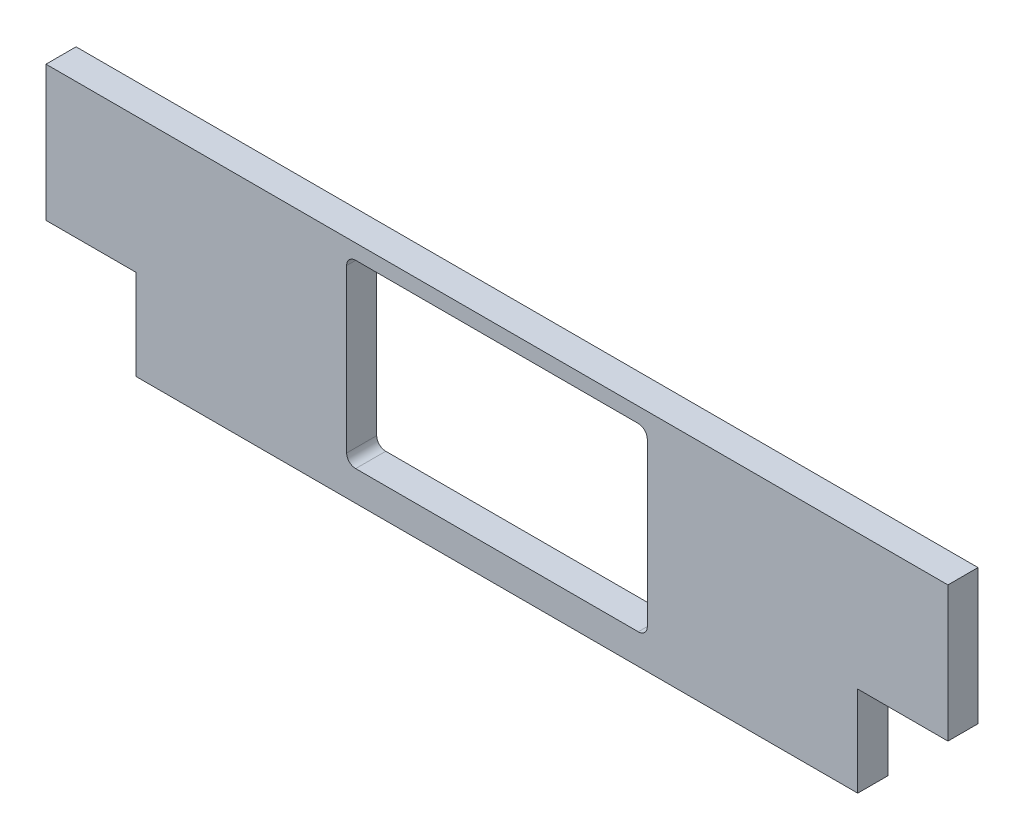
ISO-10303-21;
HEADER;
FILE_DESCRIPTION(('STEP AP214'),'2;1');
FILE_NAME('part.step','',(''),(''),'','','');
FILE_SCHEMA(('AUTOMOTIVE_DESIGN { 1 0 10303 214 1 1 1 1 }'));
ENDSEC;
DATA;
#1=APPLICATION_CONTEXT('core data for automotive mechanical design processes');
#2=APPLICATION_PROTOCOL_DEFINITION('international standard','automotive_design',2000,#1);
#3=PRODUCT_CONTEXT('',#1,'mechanical');
#4=PRODUCT('Part','Part','',(#3));
#5=PRODUCT_RELATED_PRODUCT_CATEGORY('part','',(#4));
#6=PRODUCT_DEFINITION_FORMATION('','',#4);
#7=PRODUCT_DEFINITION_CONTEXT('part definition',#1,'design');
#8=PRODUCT_DEFINITION('design','',#6,#7);
#9=PRODUCT_DEFINITION_SHAPE('','',#8);
#10=(LENGTH_UNIT() NAMED_UNIT(*) SI_UNIT(.MILLI.,.METRE.));
#11=(NAMED_UNIT(*) PLANE_ANGLE_UNIT() SI_UNIT($,.RADIAN.));
#12=(NAMED_UNIT(*) SI_UNIT($,.STERADIAN.) SOLID_ANGLE_UNIT());
#13=UNCERTAINTY_MEASURE_WITH_UNIT(LENGTH_MEASURE(1.E-05),#10,'distance_accuracy_value','');
#14=(GEOMETRIC_REPRESENTATION_CONTEXT(3) GLOBAL_UNCERTAINTY_ASSIGNED_CONTEXT((#13)) GLOBAL_UNIT_ASSIGNED_CONTEXT((#10,
#11,#12)) REPRESENTATION_CONTEXT('',''));
#15=CARTESIAN_POINT('',(0.,0.,0.));
#16=DIRECTION('',(0.,0.,1.));
#17=DIRECTION('',(1.,0.,0.));
#18=AXIS2_PLACEMENT_3D('',#15,#16,#17);
#19=CARTESIAN_POINT('',(150.,-150.,10.));
#20=DIRECTION('',(0.,1.,0.));
#21=DIRECTION('',(-1.,0.,0.));
#22=AXIS2_PLACEMENT_3D('',#19,#20,#21);
#23=PLANE('',#22);
#24=DIRECTION('',(0.,0.,-1.));
#25=VECTOR('',#24,1.);
#26=CARTESIAN_POINT('',(-120.,-150.,10.));
#27=LINE('',#26,#25);
#28=CARTESIAN_POINT('',(-120.,-150.,10.));
#29=VERTEX_POINT('',#28);
#30=CARTESIAN_POINT('',(-120.,-150.,0.));
#31=VERTEX_POINT('',#30);
#32=EDGE_CURVE('E147',#29,#31,#27,.T.);
#33=ORIENTED_EDGE('',*,*,#32,.T.);
#34=DIRECTION('',(1.,0.,0.));
#35=VECTOR('',#34,1.);
#36=CARTESIAN_POINT('',(150.,-150.,0.));
#37=LINE('',#36,#35);
#38=CARTESIAN_POINT('',(120.,-150.,0.));
#39=VERTEX_POINT('',#38);
#40=EDGE_CURVE('E54',#31,#39,#37,.T.);
#41=ORIENTED_EDGE('',*,*,#40,.T.);
#42=DIRECTION('',(0.,0.,-1.));
#43=VECTOR('',#42,1.);
#44=CARTESIAN_POINT('',(120.,-150.,10.));
#45=LINE('',#44,#43);
#46=CARTESIAN_POINT('',(120.,-150.,10.));
#47=VERTEX_POINT('',#46);
#48=EDGE_CURVE('E288',#47,#39,#45,.T.);
#49=ORIENTED_EDGE('',*,*,#48,.F.);
#50=DIRECTION('',(1.,0.,0.));
#51=VECTOR('',#50,1.);
#52=CARTESIAN_POINT('',(150.,-150.,10.));
#53=LINE('',#52,#51);
#54=EDGE_CURVE('E154',#29,#47,#53,.T.);
#55=ORIENTED_EDGE('',*,*,#54,.F.);
#56=EDGE_LOOP('',(#33,#41,#49,#55));
#57=FACE_BOUND('',#56,.T.);
#58=ADVANCED_FACE('F31',(#57),#23,.F.);
#59=CARTESIAN_POINT('',(-150.,-150.,10.));
#60=DIRECTION('',(1.,0.,0.));
#61=DIRECTION('',(0.,0.,-1.));
#62=AXIS2_PLACEMENT_3D('',#59,#60,#61);
#63=PLANE('',#62);
#64=DIRECTION('',(0.,0.,1.));
#65=VECTOR('',#64,1.);
#66=CARTESIAN_POINT('',(-150.,-120.,0.));
#67=LINE('',#66,#65);
#68=CARTESIAN_POINT('',(-150.,-120.,0.));
#69=VERTEX_POINT('',#68);
#70=CARTESIAN_POINT('',(-150.,-120.,10.));
#71=VERTEX_POINT('',#70);
#72=EDGE_CURVE('E151',#69,#71,#67,.T.);
#73=ORIENTED_EDGE('',*,*,#72,.T.);
#74=DIRECTION('',(0.,-1.,0.));
#75=VECTOR('',#74,1.);
#76=CARTESIAN_POINT('',(-150.,-150.,10.));
#77=LINE('',#76,#75);
#78=CARTESIAN_POINT('',(-150.,-75.,10.));
#79=VERTEX_POINT('',#78);
#80=EDGE_CURVE('E257',#79,#71,#77,.T.);
#81=ORIENTED_EDGE('',*,*,#80,.F.);
#82=DIRECTION('',(0.,0.,-1.));
#83=VECTOR('',#82,1.);
#84=CARTESIAN_POINT('',(-150.,-75.,10.));
#85=LINE('',#84,#83);
#86=CARTESIAN_POINT('',(-150.,-75.,0.));
#87=VERTEX_POINT('',#86);
#88=EDGE_CURVE('E172',#79,#87,#85,.T.);
#89=ORIENTED_EDGE('',*,*,#88,.T.);
#90=DIRECTION('',(0.,-1.,0.));
#91=VECTOR('',#90,1.);
#92=CARTESIAN_POINT('',(-150.,-150.,0.));
#93=LINE('',#92,#91);
#94=EDGE_CURVE('E163',#87,#69,#93,.T.);
#95=ORIENTED_EDGE('',*,*,#94,.T.);
#96=EDGE_LOOP('',(#73,#81,#89,#95));
#97=FACE_BOUND('',#96,.T.);
#98=ADVANCED_FACE('F272',(#97),#63,.F.);
#99=CARTESIAN_POINT('',(150.,-75.,10.));
#100=DIRECTION('',(0.,0.,1.));
#101=DIRECTION('',(1.,0.,0.));
#102=AXIS2_PLACEMENT_3D('',#99,#100,#101);
#103=PLANE('',#102);
#104=DIRECTION('',(0.,1.,0.));
#105=VECTOR('',#104,1.);
#106=CARTESIAN_POINT('',(50.,-140.,10.));
#107=LINE('',#106,#105);
#108=CARTESIAN_POINT('',(50.,-137.,10.));
#109=VERTEX_POINT('',#108);
#110=CARTESIAN_POINT('',(50.,-83.,10.));
#111=VERTEX_POINT('',#110);
#112=EDGE_CURVE('E215',#109,#111,#107,.T.);
#113=ORIENTED_EDGE('',*,*,#112,.F.);
#114=CARTESIAN_POINT('',(47.,-137.,10.));
#115=DIRECTION('',(0.,0.,1.));
#116=DIRECTION('',(1.,0.,0.));
#117=AXIS2_PLACEMENT_3D('',#114,#115,#116);
#118=CIRCLE('',#117,3.);
#119=CARTESIAN_POINT('',(47.,-140.,10.));
#120=VERTEX_POINT('',#119);
#121=EDGE_CURVE('E202',#109,#120,#118,.F.);
#122=ORIENTED_EDGE('',*,*,#121,.T.);
#123=DIRECTION('',(1.,0.,0.));
#124=VECTOR('',#123,1.);
#125=CARTESIAN_POINT('',(50.,-140.,10.));
#126=LINE('',#125,#124);
#127=CARTESIAN_POINT('',(-47.,-140.,10.));
#128=VERTEX_POINT('',#127);
#129=EDGE_CURVE('E243',#128,#120,#126,.T.);
#130=ORIENTED_EDGE('',*,*,#129,.F.);
#131=CARTESIAN_POINT('',(-47.,-137.,10.));
#132=DIRECTION('',(0.,0.,1.));
#133=DIRECTION('',(1.,0.,0.));
#134=AXIS2_PLACEMENT_3D('',#131,#132,#133);
#135=CIRCLE('',#134,3.);
#136=CARTESIAN_POINT('',(-50.,-137.,10.));
#137=VERTEX_POINT('',#136);
#138=EDGE_CURVE('E198',#128,#137,#135,.F.);
#139=ORIENTED_EDGE('',*,*,#138,.T.);
#140=DIRECTION('',(0.,-1.,0.));
#141=VECTOR('',#140,1.);
#142=CARTESIAN_POINT('',(-50.,-140.,10.));
#143=LINE('',#142,#141);
#144=CARTESIAN_POINT('',(-50.,-83.,10.));
#145=VERTEX_POINT('',#144);
#146=EDGE_CURVE('E251',#145,#137,#143,.T.);
#147=ORIENTED_EDGE('',*,*,#146,.F.);
#148=CARTESIAN_POINT('',(-47.,-83.,10.));
#149=DIRECTION('',(0.,0.,1.));
#150=DIRECTION('',(1.,0.,0.));
#151=AXIS2_PLACEMENT_3D('',#148,#149,#150);
#152=CIRCLE('',#151,3.);
#153=CARTESIAN_POINT('',(-47.,-80.,10.));
#154=VERTEX_POINT('',#153);
#155=EDGE_CURVE('E206',#145,#154,#152,.F.);
#156=ORIENTED_EDGE('',*,*,#155,.T.);
#157=DIRECTION('',(-1.,0.,0.));
#158=VECTOR('',#157,1.);
#159=CARTESIAN_POINT('',(50.,-80.,10.));
#160=LINE('',#159,#158);
#161=CARTESIAN_POINT('',(47.,-80.,10.));
#162=VERTEX_POINT('',#161);
#163=EDGE_CURVE('E217',#162,#154,#160,.T.);
#164=ORIENTED_EDGE('',*,*,#163,.F.);
#165=CARTESIAN_POINT('',(47.,-83.,10.));
#166=DIRECTION('',(0.,0.,1.));
#167=DIRECTION('',(1.,0.,0.));
#168=AXIS2_PLACEMENT_3D('',#165,#166,#167);
#169=CIRCLE('',#168,3.);
#170=EDGE_CURVE('E39',#162,#111,#169,.F.);
#171=ORIENTED_EDGE('',*,*,#170,.T.);
#172=EDGE_LOOP('',(#113,#122,#130,#139,#147,#156,#164,#171));
#173=FACE_BOUND('',#172,.T.);
#174=ORIENTED_EDGE('',*,*,#80,.T.);
#175=DIRECTION('',(-1.,0.,0.));
#176=VECTOR('',#175,1.);
#177=CARTESIAN_POINT('',(-120.,-120.,10.));
#178=LINE('',#177,#176);
#179=CARTESIAN_POINT('',(-120.,-120.,10.));
#180=VERTEX_POINT('',#179);
#181=EDGE_CURVE('E274',#180,#71,#178,.T.);
#182=ORIENTED_EDGE('',*,*,#181,.F.);
#183=DIRECTION('',(0.,-1.,0.));
#184=VECTOR('',#183,1.);
#185=CARTESIAN_POINT('',(-120.,-120.,10.));
#186=LINE('',#185,#184);
#187=EDGE_CURVE('E155',#180,#29,#186,.T.);
#188=ORIENTED_EDGE('',*,*,#187,.T.);
#189=ORIENTED_EDGE('',*,*,#54,.T.);
#190=DIRECTION('',(0.,-1.,0.));
#191=VECTOR('',#190,1.);
#192=CARTESIAN_POINT('',(120.,-120.,10.));
#193=LINE('',#192,#191);
#194=CARTESIAN_POINT('',(120.,-120.,10.));
#195=VERTEX_POINT('',#194);
#196=EDGE_CURVE('E285',#195,#47,#193,.T.);
#197=ORIENTED_EDGE('',*,*,#196,.F.);
#198=DIRECTION('',(1.,0.,0.));
#199=VECTOR('',#198,1.);
#200=CARTESIAN_POINT('',(120.,-120.,10.));
#201=LINE('',#200,#199);
#202=CARTESIAN_POINT('',(150.,-120.,10.));
#203=VERTEX_POINT('',#202);
#204=EDGE_CURVE('E226',#195,#203,#201,.T.);
#205=ORIENTED_EDGE('',*,*,#204,.T.);
#206=DIRECTION('',(0.,1.,0.));
#207=VECTOR('',#206,1.);
#208=CARTESIAN_POINT('',(150.,-150.,10.));
#209=LINE('',#208,#207);
#210=CARTESIAN_POINT('',(150.,-75.,10.));
#211=VERTEX_POINT('',#210);
#212=EDGE_CURVE('E162',#203,#211,#209,.T.);
#213=ORIENTED_EDGE('',*,*,#212,.T.);
#214=DIRECTION('',(-1.,0.,0.));
#215=VECTOR('',#214,1.);
#216=CARTESIAN_POINT('',(150.,-75.,10.));
#217=LINE('',#216,#215);
#218=EDGE_CURVE('E165',#211,#79,#217,.T.);
#219=ORIENTED_EDGE('',*,*,#218,.T.);
#220=EDGE_LOOP('',(#174,#182,#188,#189,#197,#205,#213,#219));
#221=FACE_BOUND('',#220,.T.);
#222=ADVANCED_FACE('F213',(#173,#221),#103,.T.);
#223=CARTESIAN_POINT('',(150.,-75.,0.));
#224=DIRECTION('',(0.,0.,1.));
#225=DIRECTION('',(1.,0.,0.));
#226=AXIS2_PLACEMENT_3D('',#223,#224,#225);
#227=PLANE('',#226);
#228=DIRECTION('',(0.,-1.,0.));
#229=VECTOR('',#228,1.);
#230=CARTESIAN_POINT('',(-50.,-140.,0.));
#231=LINE('',#230,#229);
#232=CARTESIAN_POINT('',(-50.,-83.,0.));
#233=VERTEX_POINT('',#232);
#234=CARTESIAN_POINT('',(-50.,-137.,0.));
#235=VERTEX_POINT('',#234);
#236=EDGE_CURVE('E239',#233,#235,#231,.T.);
#237=ORIENTED_EDGE('',*,*,#236,.T.);
#238=CARTESIAN_POINT('',(-47.,-137.,0.));
#239=DIRECTION('',(0.,0.,1.));
#240=DIRECTION('',(1.,0.,0.));
#241=AXIS2_PLACEMENT_3D('',#238,#239,#240);
#242=CIRCLE('',#241,3.);
#243=CARTESIAN_POINT('',(-47.,-140.,0.));
#244=VERTEX_POINT('',#243);
#245=EDGE_CURVE('E200',#235,#244,#242,.T.);
#246=ORIENTED_EDGE('',*,*,#245,.T.);
#247=DIRECTION('',(1.,0.,0.));
#248=VECTOR('',#247,1.);
#249=CARTESIAN_POINT('',(50.,-140.,0.));
#250=LINE('',#249,#248);
#251=CARTESIAN_POINT('',(47.,-140.,0.));
#252=VERTEX_POINT('',#251);
#253=EDGE_CURVE('E241',#244,#252,#250,.T.);
#254=ORIENTED_EDGE('',*,*,#253,.T.);
#255=CARTESIAN_POINT('',(47.,-137.,0.));
#256=DIRECTION('',(0.,0.,1.));
#257=DIRECTION('',(1.,0.,0.));
#258=AXIS2_PLACEMENT_3D('',#255,#256,#257);
#259=CIRCLE('',#258,3.);
#260=CARTESIAN_POINT('',(50.,-137.,0.));
#261=VERTEX_POINT('',#260);
#262=EDGE_CURVE('E204',#252,#261,#259,.T.);
#263=ORIENTED_EDGE('',*,*,#262,.T.);
#264=DIRECTION('',(0.,1.,0.));
#265=VECTOR('',#264,1.);
#266=CARTESIAN_POINT('',(50.,-140.,0.));
#267=LINE('',#266,#265);
#268=CARTESIAN_POINT('',(50.,-83.,0.));
#269=VERTEX_POINT('',#268);
#270=EDGE_CURVE('E235',#261,#269,#267,.T.);
#271=ORIENTED_EDGE('',*,*,#270,.T.);
#272=CARTESIAN_POINT('',(47.,-83.,0.));
#273=DIRECTION('',(0.,0.,1.));
#274=DIRECTION('',(1.,0.,0.));
#275=AXIS2_PLACEMENT_3D('',#272,#273,#274);
#276=CIRCLE('',#275,3.);
#277=CARTESIAN_POINT('',(47.,-80.,0.));
#278=VERTEX_POINT('',#277);
#279=EDGE_CURVE('E11',#269,#278,#276,.T.);
#280=ORIENTED_EDGE('',*,*,#279,.T.);
#281=DIRECTION('',(-1.,0.,0.));
#282=VECTOR('',#281,1.);
#283=CARTESIAN_POINT('',(50.,-80.,0.));
#284=LINE('',#283,#282);
#285=CARTESIAN_POINT('',(-47.,-80.,0.));
#286=VERTEX_POINT('',#285);
#287=EDGE_CURVE('E233',#278,#286,#284,.T.);
#288=ORIENTED_EDGE('',*,*,#287,.T.);
#289=CARTESIAN_POINT('',(-47.,-83.,0.));
#290=DIRECTION('',(0.,0.,1.));
#291=DIRECTION('',(1.,0.,0.));
#292=AXIS2_PLACEMENT_3D('',#289,#290,#291);
#293=CIRCLE('',#292,3.);
#294=EDGE_CURVE('E208',#286,#233,#293,.T.);
#295=ORIENTED_EDGE('',*,*,#294,.T.);
#296=EDGE_LOOP('',(#237,#246,#254,#263,#271,#280,#288,#295));
#297=FACE_BOUND('',#296,.T.);
#298=DIRECTION('',(-1.,0.,0.));
#299=VECTOR('',#298,1.);
#300=CARTESIAN_POINT('',(-120.,-120.,0.));
#301=LINE('',#300,#299);
#302=CARTESIAN_POINT('',(-120.,-120.,0.));
#303=VERTEX_POINT('',#302);
#304=EDGE_CURVE('E46',#303,#69,#301,.T.);
#305=ORIENTED_EDGE('',*,*,#304,.T.);
#306=ORIENTED_EDGE('',*,*,#94,.F.);
#307=DIRECTION('',(-1.,0.,0.));
#308=VECTOR('',#307,1.);
#309=CARTESIAN_POINT('',(150.,-75.,0.));
#310=LINE('',#309,#308);
#311=CARTESIAN_POINT('',(150.,-75.,0.));
#312=VERTEX_POINT('',#311);
#313=EDGE_CURVE('E168',#312,#87,#310,.T.);
#314=ORIENTED_EDGE('',*,*,#313,.F.);
#315=DIRECTION('',(0.,1.,0.));
#316=VECTOR('',#315,1.);
#317=CARTESIAN_POINT('',(150.,-150.,0.));
#318=LINE('',#317,#316);
#319=CARTESIAN_POINT('',(150.,-120.,0.));
#320=VERTEX_POINT('',#319);
#321=EDGE_CURVE('E248',#320,#312,#318,.T.);
#322=ORIENTED_EDGE('',*,*,#321,.F.);
#323=DIRECTION('',(1.,0.,0.));
#324=VECTOR('',#323,1.);
#325=CARTESIAN_POINT('',(120.,-120.,0.));
#326=LINE('',#325,#324);
#327=CARTESIAN_POINT('',(120.,-120.,0.));
#328=VERTEX_POINT('',#327);
#329=EDGE_CURVE('E289',#328,#320,#326,.T.);
#330=ORIENTED_EDGE('',*,*,#329,.F.);
#331=DIRECTION('',(0.,1.,0.));
#332=VECTOR('',#331,1.);
#333=CARTESIAN_POINT('',(120.,-150.,0.));
#334=LINE('',#333,#332);
#335=EDGE_CURVE('E161',#39,#328,#334,.T.);
#336=ORIENTED_EDGE('',*,*,#335,.F.);
#337=ORIENTED_EDGE('',*,*,#40,.F.);
#338=DIRECTION('',(0.,1.,0.));
#339=VECTOR('',#338,1.);
#340=CARTESIAN_POINT('',(-120.,-150.,0.));
#341=LINE('',#340,#339);
#342=EDGE_CURVE('E144',#31,#303,#341,.T.);
#343=ORIENTED_EDGE('',*,*,#342,.T.);
#344=EDGE_LOOP('',(#305,#306,#314,#322,#330,#336,#337,#343));
#345=FACE_BOUND('',#344,.T.);
#346=ADVANCED_FACE('F158',(#297,#345),#227,.F.);
#347=CARTESIAN_POINT('',(150.,-150.,10.));
#348=DIRECTION('',(-1.,0.,0.));
#349=DIRECTION('',(0.,0.,1.));
#350=AXIS2_PLACEMENT_3D('',#347,#348,#349);
#351=PLANE('',#350);
#352=ORIENTED_EDGE('',*,*,#212,.F.);
#353=DIRECTION('',(0.,0.,1.));
#354=VECTOR('',#353,1.);
#355=CARTESIAN_POINT('',(150.,-120.,0.));
#356=LINE('',#355,#354);
#357=EDGE_CURVE('E273',#320,#203,#356,.T.);
#358=ORIENTED_EDGE('',*,*,#357,.F.);
#359=ORIENTED_EDGE('',*,*,#321,.T.);
#360=DIRECTION('',(0.,0.,-1.));
#361=VECTOR('',#360,1.);
#362=CARTESIAN_POINT('',(150.,-75.,10.));
#363=LINE('',#362,#361);
#364=EDGE_CURVE('E175',#211,#312,#363,.T.);
#365=ORIENTED_EDGE('',*,*,#364,.F.);
#366=EDGE_LOOP('',(#352,#358,#359,#365));
#367=FACE_BOUND('',#366,.T.);
#368=ADVANCED_FACE('F297',(#367),#351,.F.);
#369=CARTESIAN_POINT('',(150.,-75.,10.));
#370=DIRECTION('',(0.,-1.,0.));
#371=DIRECTION('',(1.,0.,0.));
#372=AXIS2_PLACEMENT_3D('',#369,#370,#371);
#373=PLANE('',#372);
#374=ORIENTED_EDGE('',*,*,#313,.T.);
#375=ORIENTED_EDGE('',*,*,#88,.F.);
#376=ORIENTED_EDGE('',*,*,#218,.F.);
#377=ORIENTED_EDGE('',*,*,#364,.T.);
#378=EDGE_LOOP('',(#374,#375,#376,#377));
#379=FACE_BOUND('',#378,.T.);
#380=ADVANCED_FACE('F264',(#379),#373,.F.);
#381=CARTESIAN_POINT('',(50.,-140.,0.));
#382=DIRECTION('',(1.,0.,0.));
#383=DIRECTION('',(0.,0.,-1.));
#384=AXIS2_PLACEMENT_3D('',#381,#382,#383);
#385=PLANE('',#384);
#386=ORIENTED_EDGE('',*,*,#270,.F.);
#387=DIRECTION('',(0.,0.,1.));
#388=VECTOR('',#387,1.);
#389=CARTESIAN_POINT('',(50.,-137.,10.));
#390=LINE('',#389,#388);
#391=EDGE_CURVE('E190',#261,#109,#390,.T.);
#392=ORIENTED_EDGE('',*,*,#391,.T.);
#393=ORIENTED_EDGE('',*,*,#112,.T.);
#394=DIRECTION('',(0.,0.,1.));
#395=VECTOR('',#394,1.);
#396=CARTESIAN_POINT('',(50.,-83.,0.));
#397=LINE('',#396,#395);
#398=EDGE_CURVE('E188',#111,#269,#397,.F.);
#399=ORIENTED_EDGE('',*,*,#398,.T.);
#400=EDGE_LOOP('',(#386,#392,#393,#399));
#401=FACE_BOUND('',#400,.T.);
#402=ADVANCED_FACE('F223',(#401),#385,.F.);
#403=CARTESIAN_POINT('',(50.,-140.,0.));
#404=DIRECTION('',(0.,-1.,0.));
#405=DIRECTION('',(0.,0.,-1.));
#406=AXIS2_PLACEMENT_3D('',#403,#404,#405);
#407=PLANE('',#406);
#408=ORIENTED_EDGE('',*,*,#253,.F.);
#409=DIRECTION('',(0.,0.,1.));
#410=VECTOR('',#409,1.);
#411=CARTESIAN_POINT('',(-47.,-140.,10.));
#412=LINE('',#411,#410);
#413=EDGE_CURVE('E180',#244,#128,#412,.T.);
#414=ORIENTED_EDGE('',*,*,#413,.T.);
#415=ORIENTED_EDGE('',*,*,#129,.T.);
#416=DIRECTION('',(0.,0.,1.));
#417=VECTOR('',#416,1.);
#418=CARTESIAN_POINT('',(47.,-140.,0.));
#419=LINE('',#418,#417);
#420=EDGE_CURVE('E178',#120,#252,#419,.F.);
#421=ORIENTED_EDGE('',*,*,#420,.T.);
#422=EDGE_LOOP('',(#408,#414,#415,#421));
#423=FACE_BOUND('',#422,.T.);
#424=ADVANCED_FACE('F347',(#423),#407,.F.);
#425=CARTESIAN_POINT('',(-50.,-140.,0.));
#426=DIRECTION('',(-1.,0.,0.));
#427=DIRECTION('',(0.,0.,1.));
#428=AXIS2_PLACEMENT_3D('',#425,#426,#427);
#429=PLANE('',#428);
#430=ORIENTED_EDGE('',*,*,#146,.T.);
#431=DIRECTION('',(0.,0.,1.));
#432=VECTOR('',#431,1.);
#433=CARTESIAN_POINT('',(-50.,-137.,0.));
#434=LINE('',#433,#432);
#435=EDGE_CURVE('E186',#137,#235,#434,.F.);
#436=ORIENTED_EDGE('',*,*,#435,.T.);
#437=ORIENTED_EDGE('',*,*,#236,.F.);
#438=DIRECTION('',(0.,0.,1.));
#439=VECTOR('',#438,1.);
#440=CARTESIAN_POINT('',(-50.,-83.,10.));
#441=LINE('',#440,#439);
#442=EDGE_CURVE('E183',#233,#145,#441,.T.);
#443=ORIENTED_EDGE('',*,*,#442,.T.);
#444=EDGE_LOOP('',(#430,#436,#437,#443));
#445=FACE_BOUND('',#444,.T.);
#446=ADVANCED_FACE('F340',(#445),#429,.F.);
#447=CARTESIAN_POINT('',(50.,-80.,0.));
#448=DIRECTION('',(0.,1.,0.));
#449=DIRECTION('',(-1.,0.,0.));
#450=AXIS2_PLACEMENT_3D('',#447,#448,#449);
#451=PLANE('',#450);
#452=ORIENTED_EDGE('',*,*,#163,.T.);
#453=DIRECTION('',(0.,0.,1.));
#454=VECTOR('',#453,1.);
#455=CARTESIAN_POINT('',(-47.,-80.,0.));
#456=LINE('',#455,#454);
#457=EDGE_CURVE('E196',#154,#286,#456,.F.);
#458=ORIENTED_EDGE('',*,*,#457,.T.);
#459=ORIENTED_EDGE('',*,*,#287,.F.);
#460=DIRECTION('',(0.,0.,1.));
#461=VECTOR('',#460,1.);
#462=CARTESIAN_POINT('',(47.,-80.,10.));
#463=LINE('',#462,#461);
#464=EDGE_CURVE('E193',#278,#162,#463,.T.);
#465=ORIENTED_EDGE('',*,*,#464,.T.);
#466=EDGE_LOOP('',(#452,#458,#459,#465));
#467=FACE_BOUND('',#466,.T.);
#468=ADVANCED_FACE('F237',(#467),#451,.F.);
#469=CARTESIAN_POINT('',(-47.,-137.,0.));
#470=DIRECTION('',(0.,0.,-1.));
#471=DIRECTION('',(-1.,0.,0.));
#472=AXIS2_PLACEMENT_3D('',#469,#470,#471);
#473=CYLINDRICAL_SURFACE('',#472,3.);
#474=ORIENTED_EDGE('',*,*,#245,.F.);
#475=ORIENTED_EDGE('',*,*,#435,.F.);
#476=ORIENTED_EDGE('',*,*,#138,.F.);
#477=ORIENTED_EDGE('',*,*,#413,.F.);
#478=EDGE_LOOP('',(#474,#475,#476,#477));
#479=FACE_BOUND('',#478,.T.);
#480=ADVANCED_FACE('F323',(#479),#473,.F.);
#481=CARTESIAN_POINT('',(47.,-137.,0.));
#482=DIRECTION('',(0.,0.,-1.));
#483=DIRECTION('',(-1.,0.,0.));
#484=AXIS2_PLACEMENT_3D('',#481,#482,#483);
#485=CYLINDRICAL_SURFACE('',#484,3.);
#486=ORIENTED_EDGE('',*,*,#262,.F.);
#487=ORIENTED_EDGE('',*,*,#420,.F.);
#488=ORIENTED_EDGE('',*,*,#121,.F.);
#489=ORIENTED_EDGE('',*,*,#391,.F.);
#490=EDGE_LOOP('',(#486,#487,#488,#489));
#491=FACE_BOUND('',#490,.T.);
#492=ADVANCED_FACE('F326',(#491),#485,.F.);
#493=CARTESIAN_POINT('',(-47.,-83.,0.));
#494=DIRECTION('',(0.,0.,-1.));
#495=DIRECTION('',(-1.,0.,0.));
#496=AXIS2_PLACEMENT_3D('',#493,#494,#495);
#497=CYLINDRICAL_SURFACE('',#496,3.);
#498=ORIENTED_EDGE('',*,*,#294,.F.);
#499=ORIENTED_EDGE('',*,*,#457,.F.);
#500=ORIENTED_EDGE('',*,*,#155,.F.);
#501=ORIENTED_EDGE('',*,*,#442,.F.);
#502=EDGE_LOOP('',(#498,#499,#500,#501));
#503=FACE_BOUND('',#502,.T.);
#504=ADVANCED_FACE('F329',(#503),#497,.F.);
#505=CARTESIAN_POINT('',(47.,-83.,0.));
#506=DIRECTION('',(0.,0.,-1.));
#507=DIRECTION('',(-1.,0.,0.));
#508=AXIS2_PLACEMENT_3D('',#505,#506,#507);
#509=CYLINDRICAL_SURFACE('',#508,3.);
#510=ORIENTED_EDGE('',*,*,#279,.F.);
#511=ORIENTED_EDGE('',*,*,#398,.F.);
#512=ORIENTED_EDGE('',*,*,#170,.F.);
#513=ORIENTED_EDGE('',*,*,#464,.F.);
#514=EDGE_LOOP('',(#510,#511,#512,#513));
#515=FACE_BOUND('',#514,.T.);
#516=ADVANCED_FACE('F33',(#515),#509,.F.);
#517=CARTESIAN_POINT('',(120.,-120.,0.));
#518=DIRECTION('',(0.,1.,0.));
#519=DIRECTION('',(0.,0.,1.));
#520=AXIS2_PLACEMENT_3D('',#517,#518,#519);
#521=PLANE('',#520);
#522=ORIENTED_EDGE('',*,*,#357,.T.);
#523=ORIENTED_EDGE('',*,*,#204,.F.);
#524=DIRECTION('',(0.,0.,1.));
#525=VECTOR('',#524,1.);
#526=CARTESIAN_POINT('',(120.,-120.,0.));
#527=LINE('',#526,#525);
#528=EDGE_CURVE('E282',#328,#195,#527,.T.);
#529=ORIENTED_EDGE('',*,*,#528,.F.);
#530=ORIENTED_EDGE('',*,*,#329,.T.);
#531=EDGE_LOOP('',(#522,#523,#529,#530));
#532=FACE_BOUND('',#531,.T.);
#533=ADVANCED_FACE('F294',(#532),#521,.F.);
#534=CARTESIAN_POINT('',(120.,-120.,0.));
#535=DIRECTION('',(1.,0.,0.));
#536=DIRECTION('',(0.,0.,-1.));
#537=AXIS2_PLACEMENT_3D('',#534,#535,#536);
#538=PLANE('',#537);
#539=ORIENTED_EDGE('',*,*,#335,.T.);
#540=ORIENTED_EDGE('',*,*,#528,.T.);
#541=ORIENTED_EDGE('',*,*,#196,.T.);
#542=ORIENTED_EDGE('',*,*,#48,.T.);
#543=EDGE_LOOP('',(#539,#540,#541,#542));
#544=FACE_BOUND('',#543,.T.);
#545=ADVANCED_FACE('F300',(#544),#538,.T.);
#546=CARTESIAN_POINT('',(-120.,-120.,0.));
#547=DIRECTION('',(0.,-1.,0.));
#548=DIRECTION('',(0.,0.,-1.));
#549=AXIS2_PLACEMENT_3D('',#546,#547,#548);
#550=PLANE('',#549);
#551=ORIENTED_EDGE('',*,*,#72,.F.);
#552=ORIENTED_EDGE('',*,*,#304,.F.);
#553=DIRECTION('',(0.,0.,1.));
#554=VECTOR('',#553,1.);
#555=CARTESIAN_POINT('',(-120.,-120.,0.));
#556=LINE('',#555,#554);
#557=EDGE_CURVE('E149',#303,#180,#556,.T.);
#558=ORIENTED_EDGE('',*,*,#557,.T.);
#559=ORIENTED_EDGE('',*,*,#181,.T.);
#560=EDGE_LOOP('',(#551,#552,#558,#559));
#561=FACE_BOUND('',#560,.T.);
#562=ADVANCED_FACE('F302',(#561),#550,.T.);
#563=CARTESIAN_POINT('',(-120.,-120.,0.));
#564=DIRECTION('',(-1.,0.,0.));
#565=DIRECTION('',(0.,0.,-1.));
#566=AXIS2_PLACEMENT_3D('',#563,#564,#565);
#567=PLANE('',#566);
#568=ORIENTED_EDGE('',*,*,#342,.F.);
#569=ORIENTED_EDGE('',*,*,#32,.F.);
#570=ORIENTED_EDGE('',*,*,#187,.F.);
#571=ORIENTED_EDGE('',*,*,#557,.F.);
#572=EDGE_LOOP('',(#568,#569,#570,#571));
#573=FACE_BOUND('',#572,.T.);
#574=ADVANCED_FACE('F145',(#573),#567,.T.);
#575=CLOSED_SHELL('',(#58,#98,#222,#346,#368,#380,#402,#424,#446,#468,#480,#492,#504,#516,#533,
#545,#562,#574));
#576=MANIFOLD_SOLID_BREP('B2',#575);
#577=ADVANCED_BREP_SHAPE_REPRESENTATION('',(#18,#576),#14);
#578=SHAPE_DEFINITION_REPRESENTATION(#9,#577);
ENDSEC;
END-ISO-10303-21;
